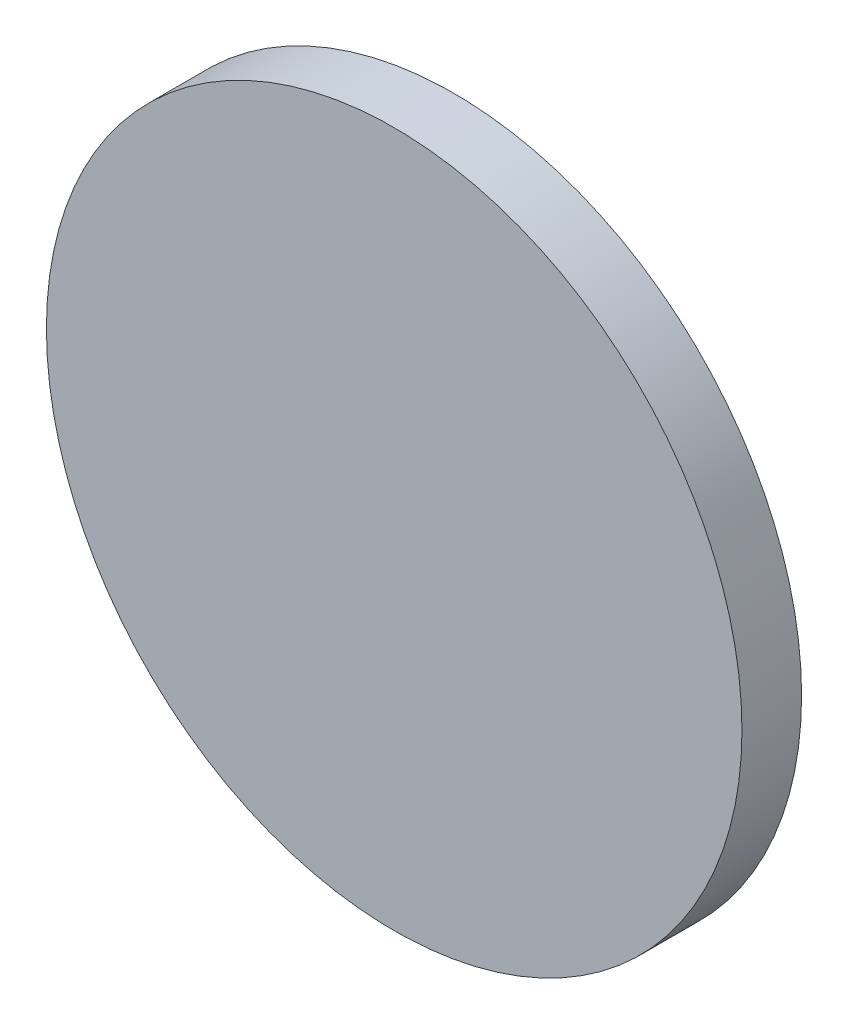
ISO-10303-21;
HEADER;
FILE_DESCRIPTION(('STEP AP214'),'2;1');
FILE_NAME('part.step','',(''),(''),'','','');
FILE_SCHEMA(('AUTOMOTIVE_DESIGN { 1 0 10303 214 1 1 1 1 }'));
ENDSEC;
DATA;
#1=APPLICATION_CONTEXT('core data for automotive mechanical design processes');
#2=APPLICATION_PROTOCOL_DEFINITION('international standard','automotive_design',2000,#1);
#3=PRODUCT_CONTEXT('',#1,'mechanical');
#4=PRODUCT('Part','Part','',(#3));
#5=PRODUCT_RELATED_PRODUCT_CATEGORY('part','',(#4));
#6=PRODUCT_DEFINITION_FORMATION('','',#4);
#7=PRODUCT_DEFINITION_CONTEXT('part definition',#1,'design');
#8=PRODUCT_DEFINITION('design','',#6,#7);
#9=PRODUCT_DEFINITION_SHAPE('','',#8);
#10=(LENGTH_UNIT() NAMED_UNIT(*) SI_UNIT(.MILLI.,.METRE.));
#11=(NAMED_UNIT(*) PLANE_ANGLE_UNIT() SI_UNIT($,.RADIAN.));
#12=(NAMED_UNIT(*) SI_UNIT($,.STERADIAN.) SOLID_ANGLE_UNIT());
#13=UNCERTAINTY_MEASURE_WITH_UNIT(LENGTH_MEASURE(1.E-05),#10,'distance_accuracy_value','');
#14=(GEOMETRIC_REPRESENTATION_CONTEXT(3) GLOBAL_UNCERTAINTY_ASSIGNED_CONTEXT((#13)) GLOBAL_UNIT_ASSIGNED_CONTEXT((#10,
#11,#12)) REPRESENTATION_CONTEXT('',''));
#15=CARTESIAN_POINT('',(0.,0.,0.));
#16=DIRECTION('',(0.,0.,1.));
#17=DIRECTION('',(1.,0.,0.));
#18=AXIS2_PLACEMENT_3D('',#15,#16,#17);
#19=CARTESIAN_POINT('',(4.19608,1.78308,0.));
#20=DIRECTION('',(0.,0.,-1.));
#21=DIRECTION('',(-1.,0.,0.));
#22=AXIS2_PLACEMENT_3D('',#19,#20,#21);
#23=PLANE('',#22);
#24=CARTESIAN_POINT('',(4.19608,1.78308,0.));
#25=DIRECTION('',(0.,0.,1.));
#26=DIRECTION('',(1.,0.,0.));
#27=AXIS2_PLACEMENT_3D('',#24,#25,#26);
#28=CIRCLE('',#27,0.200024667);
#29=CARTESIAN_POINT('',(4.396104667,1.78308,0.));
#30=VERTEX_POINT('',#29);
#31=EDGE_CURVE('E18',#30,#30,#28,.T.);
#32=ORIENTED_EDGE('',*,*,#31,.F.);
#33=EDGE_LOOP('',(#32));
#34=FACE_BOUND('',#33,.T.);
#35=ADVANCED_FACE('F15',(#34),#23,.T.);
#36=CARTESIAN_POINT('',(4.19608,1.78308,0.));
#37=DIRECTION('',(0.,0.,1.));
#38=DIRECTION('',(1.,0.,0.));
#39=AXIS2_PLACEMENT_3D('',#36,#37,#38);
#40=CYLINDRICAL_SURFACE('',#39,0.200024667);
#41=CARTESIAN_POINT('',(4.19608,1.78308,0.03429));
#42=DIRECTION('',(0.,0.,1.));
#43=DIRECTION('',(1.,0.,0.));
#44=AXIS2_PLACEMENT_3D('',#41,#42,#43);
#45=CIRCLE('',#44,0.200024667);
#46=CARTESIAN_POINT('',(4.396104667,1.78308,0.03429));
#47=VERTEX_POINT('',#46);
#48=EDGE_CURVE('E10',#47,#47,#45,.T.);
#49=ORIENTED_EDGE('',*,*,#48,.F.);
#50=EDGE_LOOP('',(#49));
#51=FACE_BOUND('',#50,.T.);
#52=ORIENTED_EDGE('',*,*,#31,.T.);
#53=EDGE_LOOP('',(#52));
#54=FACE_BOUND('',#53,.T.);
#55=ADVANCED_FACE('F27',(#51,#54),#40,.T.);
#56=CARTESIAN_POINT('',(4.19608,1.78308,0.03429));
#57=DIRECTION('',(0.,0.,1.));
#58=DIRECTION('',(1.,0.,0.));
#59=AXIS2_PLACEMENT_3D('',#56,#57,#58);
#60=PLANE('',#59);
#61=ORIENTED_EDGE('',*,*,#48,.T.);
#62=EDGE_LOOP('',(#61));
#63=FACE_BOUND('',#62,.T.);
#64=ADVANCED_FACE('F34',(#63),#60,.T.);
#65=CLOSED_SHELL('',(#35,#55,#64));
#66=MANIFOLD_SOLID_BREP('B1',#65);
#67=ADVANCED_BREP_SHAPE_REPRESENTATION('',(#18,#66),#14);
#68=SHAPE_DEFINITION_REPRESENTATION(#9,#67);
ENDSEC;
END-ISO-10303-21;
